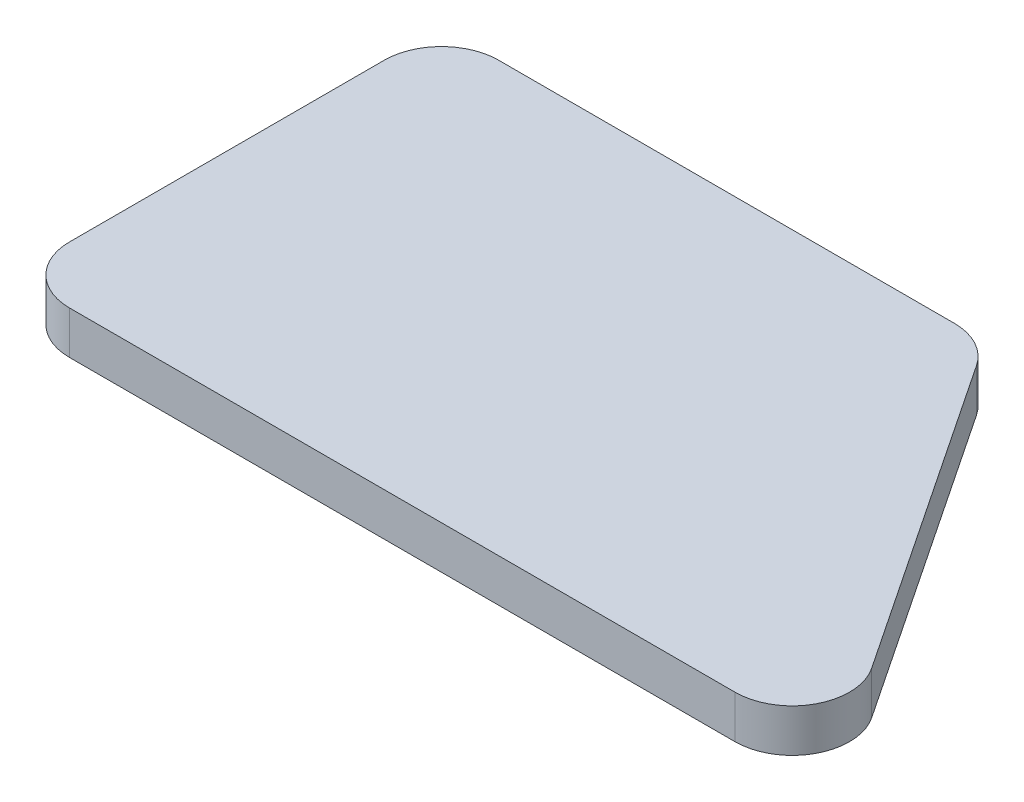
ISO-10303-21;
HEADER;
FILE_DESCRIPTION(('STEP AP214'),'2;1');
FILE_NAME('part.step','',(''),(''),'','','');
FILE_SCHEMA(('AUTOMOTIVE_DESIGN { 1 0 10303 214 1 1 1 1 }'));
ENDSEC;
DATA;
#1=APPLICATION_CONTEXT('core data for automotive mechanical design processes');
#2=APPLICATION_PROTOCOL_DEFINITION('international standard','automotive_design',2000,#1);
#3=PRODUCT_CONTEXT('',#1,'mechanical');
#4=PRODUCT('Part','Part','',(#3));
#5=PRODUCT_RELATED_PRODUCT_CATEGORY('part','',(#4));
#6=PRODUCT_DEFINITION_FORMATION('','',#4);
#7=PRODUCT_DEFINITION_CONTEXT('part definition',#1,'design');
#8=PRODUCT_DEFINITION('design','',#6,#7);
#9=PRODUCT_DEFINITION_SHAPE('','',#8);
#10=(LENGTH_UNIT() NAMED_UNIT(*) SI_UNIT(.MILLI.,.METRE.));
#11=(NAMED_UNIT(*) PLANE_ANGLE_UNIT() SI_UNIT($,.RADIAN.));
#12=(NAMED_UNIT(*) SI_UNIT($,.STERADIAN.) SOLID_ANGLE_UNIT());
#13=UNCERTAINTY_MEASURE_WITH_UNIT(LENGTH_MEASURE(1.E-05),#10,'distance_accuracy_value','');
#14=(GEOMETRIC_REPRESENTATION_CONTEXT(3) GLOBAL_UNCERTAINTY_ASSIGNED_CONTEXT((#13)) GLOBAL_UNIT_ASSIGNED_CONTEXT((#10,
#11,#12)) REPRESENTATION_CONTEXT('',''));
#15=CARTESIAN_POINT('',(0.,0.,0.));
#16=DIRECTION('',(0.,0.,1.));
#17=DIRECTION('',(1.,0.,0.));
#18=AXIS2_PLACEMENT_3D('',#15,#16,#17);
#19=CARTESIAN_POINT('',(6.26296581635734,1.5,13.));
#20=DIRECTION('',(0.,-1.,0.));
#21=DIRECTION('',(0.,0.,-1.));
#22=AXIS2_PLACEMENT_3D('',#19,#20,#21);
#23=CYLINDRICAL_SURFACE('',#22,2.);
#24=CARTESIAN_POINT('',(6.26296581635734,0.,13.));
#25=DIRECTION('',(0.,1.,0.));
#26=DIRECTION('',(0.,0.,1.));
#27=AXIS2_PLACEMENT_3D('',#24,#25,#26);
#28=CIRCLE('',#27,2.);
#29=CARTESIAN_POINT('',(6.26296581635731,0.,15.));
#30=VERTEX_POINT('',#29);
#31=CARTESIAN_POINT('',(7.92706640503301,0.,11.8905996075495));
#32=VERTEX_POINT('',#31);
#33=EDGE_CURVE('E135',#30,#32,#28,.T.);
#34=ORIENTED_EDGE('',*,*,#33,.T.);
#35=DIRECTION('',(0.,-1.,0.));
#36=VECTOR('',#35,1.);
#37=CARTESIAN_POINT('',(7.92706640503301,1.5,11.8905996075495));
#38=LINE('',#37,#36);
#39=CARTESIAN_POINT('',(7.92706640503301,1.5,11.8905996075495));
#40=VERTEX_POINT('',#39);
#41=EDGE_CURVE('E11',#40,#32,#38,.T.);
#42=ORIENTED_EDGE('',*,*,#41,.F.);
#43=CARTESIAN_POINT('',(6.26296581635734,1.5,13.));
#44=DIRECTION('',(0.,1.,0.));
#45=DIRECTION('',(0.,0.,1.));
#46=AXIS2_PLACEMENT_3D('',#43,#44,#45);
#47=CIRCLE('',#46,2.);
#48=CARTESIAN_POINT('',(6.26296581635731,1.5,15.));
#49=VERTEX_POINT('',#48);
#50=EDGE_CURVE('E149',#49,#40,#47,.T.);
#51=ORIENTED_EDGE('',*,*,#50,.F.);
#52=DIRECTION('',(0.,-1.,0.));
#53=VECTOR('',#52,1.);
#54=CARTESIAN_POINT('',(6.26296581635731,1.5,15.));
#55=LINE('',#54,#53);
#56=EDGE_CURVE('E131',#49,#30,#55,.T.);
#57=ORIENTED_EDGE('',*,*,#56,.T.);
#58=EDGE_LOOP('',(#34,#42,#51,#57));
#59=FACE_BOUND('',#58,.T.);
#60=ADVANCED_FACE('F39',(#59),#23,.T.);
#61=CARTESIAN_POINT('',(0.5937330716997,1.5,0.890599607549549));
#62=DIRECTION('',(-0.832050294337843,0.,0.554700196225229));
#63=DIRECTION('',(0.554700196225229,0.,0.832050294337844));
#64=AXIS2_PLACEMENT_3D('',#61,#62,#63);
#65=PLANE('',#64);
#66=DIRECTION('',(-0.554700196225229,0.,-0.832050294337844));
#67=VECTOR('',#66,1.);
#68=CARTESIAN_POINT('',(0.5937330716997,0.,0.890599607549549));
#69=LINE('',#68,#67);
#70=CARTESIAN_POINT('',(0.593733071699699,0.,0.890599607549549));
#71=VERTEX_POINT('',#70);
#72=EDGE_CURVE('E138',#32,#71,#69,.T.);
#73=ORIENTED_EDGE('',*,*,#72,.T.);
#74=DIRECTION('',(0.,-1.,0.));
#75=VECTOR('',#74,1.);
#76=CARTESIAN_POINT('',(0.593733071699699,1.5,0.890599607549549));
#77=LINE('',#76,#75);
#78=CARTESIAN_POINT('',(0.593733071699699,1.5,0.890599607549549));
#79=VERTEX_POINT('',#78);
#80=EDGE_CURVE('E47',#79,#71,#77,.T.);
#81=ORIENTED_EDGE('',*,*,#80,.F.);
#82=DIRECTION('',(-0.554700196225229,0.,-0.832050294337844));
#83=VECTOR('',#82,1.);
#84=CARTESIAN_POINT('',(0.5937330716997,1.5,0.890599607549549));
#85=LINE('',#84,#83);
#86=EDGE_CURVE('E98',#40,#79,#85,.T.);
#87=ORIENTED_EDGE('',*,*,#86,.F.);
#88=ORIENTED_EDGE('',*,*,#41,.T.);
#89=EDGE_LOOP('',(#73,#81,#87,#88));
#90=FACE_BOUND('',#89,.T.);
#91=ADVANCED_FACE('F184',(#90),#65,.F.);
#92=CARTESIAN_POINT('',(-1.07036751697599,1.5,2.));
#93=DIRECTION('',(0.,-1.,0.));
#94=DIRECTION('',(0.,0.,-1.));
#95=AXIS2_PLACEMENT_3D('',#92,#93,#94);
#96=CYLINDRICAL_SURFACE('',#95,2.);
#97=CARTESIAN_POINT('',(-1.07036751697599,0.,2.));
#98=DIRECTION('',(0.,1.,0.));
#99=DIRECTION('',(0.,0.,-1.));
#100=AXIS2_PLACEMENT_3D('',#97,#98,#99);
#101=CIRCLE('',#100,2.);
#102=CARTESIAN_POINT('',(-1.070367516976,0.,0.));
#103=VERTEX_POINT('',#102);
#104=EDGE_CURVE('E140',#71,#103,#101,.T.);
#105=ORIENTED_EDGE('',*,*,#104,.T.);
#106=DIRECTION('',(0.,-1.,0.));
#107=VECTOR('',#106,1.);
#108=CARTESIAN_POINT('',(-1.070367516976,1.5,0.));
#109=LINE('',#108,#107);
#110=CARTESIAN_POINT('',(-1.070367516976,1.5,0.));
#111=VERTEX_POINT('',#110);
#112=EDGE_CURVE('E156',#111,#103,#109,.T.);
#113=ORIENTED_EDGE('',*,*,#112,.F.);
#114=CARTESIAN_POINT('',(-1.07036751697599,1.5,2.));
#115=DIRECTION('',(0.,1.,0.));
#116=DIRECTION('',(0.,0.,-1.));
#117=AXIS2_PLACEMENT_3D('',#114,#115,#116);
#118=CIRCLE('',#117,2.);
#119=EDGE_CURVE('E164',#79,#111,#118,.T.);
#120=ORIENTED_EDGE('',*,*,#119,.F.);
#121=ORIENTED_EDGE('',*,*,#80,.T.);
#122=EDGE_LOOP('',(#105,#113,#120,#121));
#123=FACE_BOUND('',#122,.T.);
#124=ADVANCED_FACE('F162',(#123),#96,.T.);
#125=CARTESIAN_POINT('',(-1.070367516976,1.5,0.));
#126=DIRECTION('',(0.,0.,1.));
#127=DIRECTION('',(1.,0.,0.));
#128=AXIS2_PLACEMENT_3D('',#125,#126,#127);
#129=PLANE('',#128);
#130=DIRECTION('',(-1.,0.,0.));
#131=VECTOR('',#130,1.);
#132=CARTESIAN_POINT('',(-1.070367516976,0.,0.));
#133=LINE('',#132,#131);
#134=CARTESIAN_POINT('',(-17.,0.,0.));
#135=VERTEX_POINT('',#134);
#136=EDGE_CURVE('E142',#103,#135,#133,.T.);
#137=ORIENTED_EDGE('',*,*,#136,.T.);
#138=DIRECTION('',(0.,-1.,0.));
#139=VECTOR('',#138,1.);
#140=CARTESIAN_POINT('',(-17.,1.5,0.));
#141=LINE('',#140,#139);
#142=CARTESIAN_POINT('',(-17.,1.5,0.));
#143=VERTEX_POINT('',#142);
#144=EDGE_CURVE('E153',#143,#135,#141,.T.);
#145=ORIENTED_EDGE('',*,*,#144,.F.);
#146=DIRECTION('',(-1.,0.,0.));
#147=VECTOR('',#146,1.);
#148=CARTESIAN_POINT('',(-1.070367516976,1.5,0.));
#149=LINE('',#148,#147);
#150=EDGE_CURVE('E176',#111,#143,#149,.T.);
#151=ORIENTED_EDGE('',*,*,#150,.F.);
#152=ORIENTED_EDGE('',*,*,#112,.T.);
#153=EDGE_LOOP('',(#137,#145,#151,#152));
#154=FACE_BOUND('',#153,.T.);
#155=ADVANCED_FACE('F172',(#154),#129,.F.);
#156=CARTESIAN_POINT('',(-17.,1.5,2.));
#157=DIRECTION('',(0.,-1.,0.));
#158=DIRECTION('',(0.,0.,-1.));
#159=AXIS2_PLACEMENT_3D('',#156,#157,#158);
#160=CYLINDRICAL_SURFACE('',#159,2.);
#161=CARTESIAN_POINT('',(-17.,0.,2.));
#162=DIRECTION('',(0.,1.,0.));
#163=DIRECTION('',(0.,0.,1.));
#164=AXIS2_PLACEMENT_3D('',#161,#162,#163);
#165=CIRCLE('',#164,2.);
#166=CARTESIAN_POINT('',(-19.,0.,2.00000000000001));
#167=VERTEX_POINT('',#166);
#168=EDGE_CURVE('E144',#135,#167,#165,.T.);
#169=ORIENTED_EDGE('',*,*,#168,.T.);
#170=DIRECTION('',(0.,-1.,0.));
#171=VECTOR('',#170,1.);
#172=CARTESIAN_POINT('',(-19.,1.5,2.00000000000001));
#173=LINE('',#172,#171);
#174=CARTESIAN_POINT('',(-19.,1.5,2.00000000000001));
#175=VERTEX_POINT('',#174);
#176=EDGE_CURVE('E126',#175,#167,#173,.T.);
#177=ORIENTED_EDGE('',*,*,#176,.F.);
#178=CARTESIAN_POINT('',(-17.,1.5,2.));
#179=DIRECTION('',(0.,1.,0.));
#180=DIRECTION('',(0.,0.,1.));
#181=AXIS2_PLACEMENT_3D('',#178,#179,#180);
#182=CIRCLE('',#181,2.);
#183=EDGE_CURVE('E117',#143,#175,#182,.T.);
#184=ORIENTED_EDGE('',*,*,#183,.F.);
#185=ORIENTED_EDGE('',*,*,#144,.T.);
#186=EDGE_LOOP('',(#169,#177,#184,#185));
#187=FACE_BOUND('',#186,.T.);
#188=ADVANCED_FACE('F175',(#187),#160,.T.);
#189=CARTESIAN_POINT('',(-19.,1.5,2.00000000000001));
#190=DIRECTION('',(1.,0.,0.));
#191=DIRECTION('',(0.,0.,-1.));
#192=AXIS2_PLACEMENT_3D('',#189,#190,#191);
#193=PLANE('',#192);
#194=DIRECTION('',(0.,0.,1.));
#195=VECTOR('',#194,1.);
#196=CARTESIAN_POINT('',(-19.,0.,2.00000000000001));
#197=LINE('',#196,#195);
#198=CARTESIAN_POINT('',(-19.,0.,13.));
#199=VERTEX_POINT('',#198);
#200=EDGE_CURVE('E125',#167,#199,#197,.T.);
#201=ORIENTED_EDGE('',*,*,#200,.T.);
#202=DIRECTION('',(0.,-1.,0.));
#203=VECTOR('',#202,1.);
#204=CARTESIAN_POINT('',(-19.,1.5,13.));
#205=LINE('',#204,#203);
#206=CARTESIAN_POINT('',(-19.,1.5,13.));
#207=VERTEX_POINT('',#206);
#208=EDGE_CURVE('E122',#207,#199,#205,.T.);
#209=ORIENTED_EDGE('',*,*,#208,.F.);
#210=DIRECTION('',(0.,0.,1.));
#211=VECTOR('',#210,1.);
#212=CARTESIAN_POINT('',(-19.,1.5,2.00000000000001));
#213=LINE('',#212,#211);
#214=EDGE_CURVE('E111',#175,#207,#213,.T.);
#215=ORIENTED_EDGE('',*,*,#214,.F.);
#216=ORIENTED_EDGE('',*,*,#176,.T.);
#217=EDGE_LOOP('',(#201,#209,#215,#216));
#218=FACE_BOUND('',#217,.T.);
#219=ADVANCED_FACE('F123',(#218),#193,.F.);
#220=CARTESIAN_POINT('',(-17.,1.5,13.));
#221=DIRECTION('',(0.,-1.,0.));
#222=DIRECTION('',(0.,0.,-1.));
#223=AXIS2_PLACEMENT_3D('',#220,#221,#222);
#224=CYLINDRICAL_SURFACE('',#223,2.);
#225=CARTESIAN_POINT('',(-17.,0.,13.));
#226=DIRECTION('',(0.,1.,0.));
#227=DIRECTION('',(0.,0.,1.));
#228=AXIS2_PLACEMENT_3D('',#225,#226,#227);
#229=CIRCLE('',#228,2.);
#230=CARTESIAN_POINT('',(-17.,0.,15.));
#231=VERTEX_POINT('',#230);
#232=EDGE_CURVE('E84',#199,#231,#229,.T.);
#233=ORIENTED_EDGE('',*,*,#232,.T.);
#234=DIRECTION('',(0.,-1.,0.));
#235=VECTOR('',#234,1.);
#236=CARTESIAN_POINT('',(-17.,1.5,15.));
#237=LINE('',#236,#235);
#238=CARTESIAN_POINT('',(-17.,1.5,15.));
#239=VERTEX_POINT('',#238);
#240=EDGE_CURVE('E127',#239,#231,#237,.T.);
#241=ORIENTED_EDGE('',*,*,#240,.F.);
#242=CARTESIAN_POINT('',(-17.,1.5,13.));
#243=DIRECTION('',(0.,1.,0.));
#244=DIRECTION('',(0.,0.,1.));
#245=AXIS2_PLACEMENT_3D('',#242,#243,#244);
#246=CIRCLE('',#245,2.);
#247=EDGE_CURVE('E115',#207,#239,#246,.T.);
#248=ORIENTED_EDGE('',*,*,#247,.F.);
#249=ORIENTED_EDGE('',*,*,#208,.T.);
#250=EDGE_LOOP('',(#233,#241,#248,#249));
#251=FACE_BOUND('',#250,.T.);
#252=ADVANCED_FACE('F129',(#251),#224,.T.);
#253=CARTESIAN_POINT('',(-17.,1.5,15.));
#254=DIRECTION('',(0.,0.,-1.));
#255=DIRECTION('',(-1.,0.,0.));
#256=AXIS2_PLACEMENT_3D('',#253,#254,#255);
#257=PLANE('',#256);
#258=DIRECTION('',(1.,0.,0.));
#259=VECTOR('',#258,1.);
#260=CARTESIAN_POINT('',(-17.,0.,15.));
#261=LINE('',#260,#259);
#262=EDGE_CURVE('E90',#231,#30,#261,.T.);
#263=ORIENTED_EDGE('',*,*,#262,.T.);
#264=ORIENTED_EDGE('',*,*,#56,.F.);
#265=DIRECTION('',(1.,0.,0.));
#266=VECTOR('',#265,1.);
#267=CARTESIAN_POINT('',(-17.,1.5,15.));
#268=LINE('',#267,#266);
#269=EDGE_CURVE('E55',#239,#49,#268,.T.);
#270=ORIENTED_EDGE('',*,*,#269,.F.);
#271=ORIENTED_EDGE('',*,*,#240,.T.);
#272=EDGE_LOOP('',(#263,#264,#270,#271));
#273=FACE_BOUND('',#272,.T.);
#274=ADVANCED_FACE('F200',(#273),#257,.F.);
#275=CARTESIAN_POINT('',(6.26296581635734,1.5,13.));
#276=DIRECTION('',(0.,1.,0.));
#277=DIRECTION('',(0.,0.,1.));
#278=AXIS2_PLACEMENT_3D('',#275,#276,#277);
#279=PLANE('',#278);
#280=ORIENTED_EDGE('',*,*,#50,.T.);
#281=ORIENTED_EDGE('',*,*,#86,.T.);
#282=ORIENTED_EDGE('',*,*,#119,.T.);
#283=ORIENTED_EDGE('',*,*,#150,.T.);
#284=ORIENTED_EDGE('',*,*,#183,.T.);
#285=ORIENTED_EDGE('',*,*,#214,.T.);
#286=ORIENTED_EDGE('',*,*,#247,.T.);
#287=ORIENTED_EDGE('',*,*,#269,.T.);
#288=EDGE_LOOP('',(#280,#281,#282,#283,#284,#285,#286,#287));
#289=FACE_BOUND('',#288,.T.);
#290=ADVANCED_FACE('F113',(#289),#279,.T.);
#291=CARTESIAN_POINT('',(6.26296581635734,0.,13.));
#292=DIRECTION('',(0.,1.,0.));
#293=DIRECTION('',(0.,0.,1.));
#294=AXIS2_PLACEMENT_3D('',#291,#292,#293);
#295=PLANE('',#294);
#296=ORIENTED_EDGE('',*,*,#33,.F.);
#297=ORIENTED_EDGE('',*,*,#262,.F.);
#298=ORIENTED_EDGE('',*,*,#232,.F.);
#299=ORIENTED_EDGE('',*,*,#200,.F.);
#300=ORIENTED_EDGE('',*,*,#168,.F.);
#301=ORIENTED_EDGE('',*,*,#136,.F.);
#302=ORIENTED_EDGE('',*,*,#104,.F.);
#303=ORIENTED_EDGE('',*,*,#72,.F.);
#304=EDGE_LOOP('',(#296,#297,#298,#299,#300,#301,#302,#303));
#305=FACE_BOUND('',#304,.T.);
#306=ADVANCED_FACE('F168',(#305),#295,.F.);
#307=CLOSED_SHELL('',(#60,#91,#124,#155,#188,#219,#252,#274,#290,#306));
#308=MANIFOLD_SOLID_BREP('B2',#307);
#309=ADVANCED_BREP_SHAPE_REPRESENTATION('',(#18,#308),#14);
#310=SHAPE_DEFINITION_REPRESENTATION(#9,#309);
ENDSEC;
END-ISO-10303-21;
